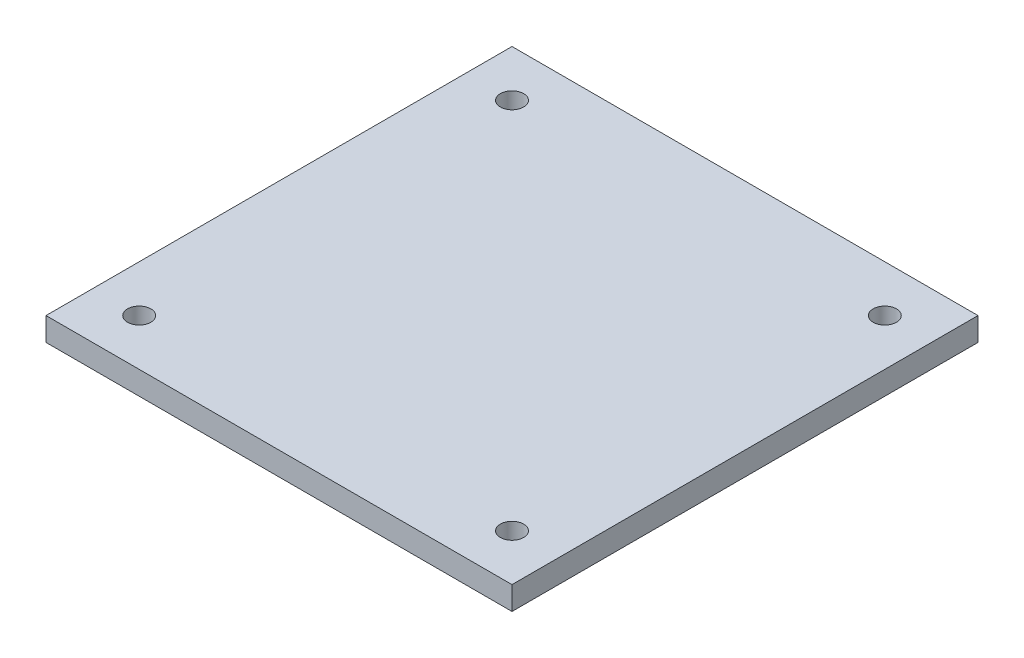
ISO-10303-21;
HEADER;
FILE_DESCRIPTION(('STEP AP214'),'2;1');
FILE_NAME('part.step','',(''),(''),'','','');
FILE_SCHEMA(('AUTOMOTIVE_DESIGN { 1 0 10303 214 1 1 1 1 }'));
ENDSEC;
DATA;
#1=APPLICATION_CONTEXT('core data for automotive mechanical design processes');
#2=APPLICATION_PROTOCOL_DEFINITION('international standard','automotive_design',2000,#1);
#3=PRODUCT_CONTEXT('',#1,'mechanical');
#4=PRODUCT('Part','Part','',(#3));
#5=PRODUCT_RELATED_PRODUCT_CATEGORY('part','',(#4));
#6=PRODUCT_DEFINITION_FORMATION('','',#4);
#7=PRODUCT_DEFINITION_CONTEXT('part definition',#1,'design');
#8=PRODUCT_DEFINITION('design','',#6,#7);
#9=PRODUCT_DEFINITION_SHAPE('','',#8);
#10=(LENGTH_UNIT() NAMED_UNIT(*) SI_UNIT(.MILLI.,.METRE.));
#11=(NAMED_UNIT(*) PLANE_ANGLE_UNIT() SI_UNIT($,.RADIAN.));
#12=(NAMED_UNIT(*) SI_UNIT($,.STERADIAN.) SOLID_ANGLE_UNIT());
#13=UNCERTAINTY_MEASURE_WITH_UNIT(LENGTH_MEASURE(1.E-05),#10,'distance_accuracy_value','');
#14=(GEOMETRIC_REPRESENTATION_CONTEXT(3) GLOBAL_UNCERTAINTY_ASSIGNED_CONTEXT((#13)) GLOBAL_UNIT_ASSIGNED_CONTEXT((#10,
#11,#12)) REPRESENTATION_CONTEXT('',''));
#15=CARTESIAN_POINT('',(0.,0.,0.));
#16=DIRECTION('',(0.,0.,1.));
#17=DIRECTION('',(1.,0.,0.));
#18=AXIS2_PLACEMENT_3D('',#15,#16,#17);
#19=CARTESIAN_POINT('',(100.,10.,100.));
#20=DIRECTION('',(-1.,0.,0.));
#21=DIRECTION('',(0.,0.,1.));
#22=AXIS2_PLACEMENT_3D('',#19,#20,#21);
#23=PLANE('',#22);
#24=DIRECTION('',(0.,0.,-1.));
#25=VECTOR('',#24,1.);
#26=CARTESIAN_POINT('',(100.,0.,100.));
#27=LINE('',#26,#25);
#28=CARTESIAN_POINT('',(100.,0.,100.));
#29=VERTEX_POINT('',#28);
#30=CARTESIAN_POINT('',(100.,0.,-100.));
#31=VERTEX_POINT('',#30);
#32=EDGE_CURVE('E214',#29,#31,#27,.T.);
#33=ORIENTED_EDGE('',*,*,#32,.T.);
#34=DIRECTION('',(0.,-1.,0.));
#35=VECTOR('',#34,1.);
#36=CARTESIAN_POINT('',(100.,10.,-100.));
#37=LINE('',#36,#35);
#38=CARTESIAN_POINT('',(100.,10.,-100.));
#39=VERTEX_POINT('',#38);
#40=EDGE_CURVE('E12',#39,#31,#37,.T.);
#41=ORIENTED_EDGE('',*,*,#40,.F.);
#42=DIRECTION('',(0.,0.,-1.));
#43=VECTOR('',#42,1.);
#44=CARTESIAN_POINT('',(100.,10.,100.));
#45=LINE('',#44,#43);
#46=CARTESIAN_POINT('',(100.,10.,100.));
#47=VERTEX_POINT('',#46);
#48=EDGE_CURVE('E98',#47,#39,#45,.T.);
#49=ORIENTED_EDGE('',*,*,#48,.F.);
#50=DIRECTION('',(0.,-1.,0.));
#51=VECTOR('',#50,1.);
#52=CARTESIAN_POINT('',(100.,10.,100.));
#53=LINE('',#52,#51);
#54=EDGE_CURVE('E110',#47,#29,#53,.T.);
#55=ORIENTED_EDGE('',*,*,#54,.T.);
#56=EDGE_LOOP('',(#33,#41,#49,#55));
#57=FACE_BOUND('',#56,.T.);
#58=ADVANCED_FACE('F45',(#57),#23,.F.);
#59=CARTESIAN_POINT('',(-100.,10.,-100.));
#60=DIRECTION('',(0.,0.,1.));
#61=DIRECTION('',(1.,0.,0.));
#62=AXIS2_PLACEMENT_3D('',#59,#60,#61);
#63=PLANE('',#62);
#64=DIRECTION('',(-1.,0.,0.));
#65=VECTOR('',#64,1.);
#66=CARTESIAN_POINT('',(-100.,0.,-100.));
#67=LINE('',#66,#65);
#68=CARTESIAN_POINT('',(-100.,0.,-100.));
#69=VERTEX_POINT('',#68);
#70=EDGE_CURVE('E103',#31,#69,#67,.T.);
#71=ORIENTED_EDGE('',*,*,#70,.T.);
#72=DIRECTION('',(0.,-1.,0.));
#73=VECTOR('',#72,1.);
#74=CARTESIAN_POINT('',(-100.,10.,-100.));
#75=LINE('',#74,#73);
#76=CARTESIAN_POINT('',(-100.,10.,-100.));
#77=VERTEX_POINT('',#76);
#78=EDGE_CURVE('E55',#77,#69,#75,.T.);
#79=ORIENTED_EDGE('',*,*,#78,.F.);
#80=DIRECTION('',(-1.,0.,0.));
#81=VECTOR('',#80,1.);
#82=CARTESIAN_POINT('',(-100.,10.,-100.));
#83=LINE('',#82,#81);
#84=EDGE_CURVE('E93',#39,#77,#83,.T.);
#85=ORIENTED_EDGE('',*,*,#84,.F.);
#86=ORIENTED_EDGE('',*,*,#40,.T.);
#87=EDGE_LOOP('',(#71,#79,#85,#86));
#88=FACE_BOUND('',#87,.T.);
#89=ADVANCED_FACE('F102',(#88),#63,.F.);
#90=CARTESIAN_POINT('',(-100.,10.,100.));
#91=DIRECTION('',(1.,0.,0.));
#92=DIRECTION('',(0.,0.,-1.));
#93=AXIS2_PLACEMENT_3D('',#90,#91,#92);
#94=PLANE('',#93);
#95=DIRECTION('',(0.,0.,1.));
#96=VECTOR('',#95,1.);
#97=CARTESIAN_POINT('',(-100.,0.,100.));
#98=LINE('',#97,#96);
#99=CARTESIAN_POINT('',(-100.,0.,100.));
#100=VERTEX_POINT('',#99);
#101=EDGE_CURVE('E80',#69,#100,#98,.T.);
#102=ORIENTED_EDGE('',*,*,#101,.T.);
#103=DIRECTION('',(0.,-1.,0.));
#104=VECTOR('',#103,1.);
#105=CARTESIAN_POINT('',(-100.,10.,100.));
#106=LINE('',#105,#104);
#107=CARTESIAN_POINT('',(-100.,10.,100.));
#108=VERTEX_POINT('',#107);
#109=EDGE_CURVE('E105',#108,#100,#106,.T.);
#110=ORIENTED_EDGE('',*,*,#109,.F.);
#111=DIRECTION('',(0.,0.,1.));
#112=VECTOR('',#111,1.);
#113=CARTESIAN_POINT('',(-100.,10.,100.));
#114=LINE('',#113,#112);
#115=EDGE_CURVE('E96',#77,#108,#114,.T.);
#116=ORIENTED_EDGE('',*,*,#115,.F.);
#117=ORIENTED_EDGE('',*,*,#78,.T.);
#118=EDGE_LOOP('',(#102,#110,#116,#117));
#119=FACE_BOUND('',#118,.T.);
#120=ADVANCED_FACE('F106',(#119),#94,.F.);
#121=CARTESIAN_POINT('',(-100.,10.,100.));
#122=DIRECTION('',(0.,0.,-1.));
#123=DIRECTION('',(-1.,0.,0.));
#124=AXIS2_PLACEMENT_3D('',#121,#122,#123);
#125=PLANE('',#124);
#126=DIRECTION('',(1.,0.,0.));
#127=VECTOR('',#126,1.);
#128=CARTESIAN_POINT('',(-100.,0.,100.));
#129=LINE('',#128,#127);
#130=EDGE_CURVE('E86',#100,#29,#129,.T.);
#131=ORIENTED_EDGE('',*,*,#130,.T.);
#132=ORIENTED_EDGE('',*,*,#54,.F.);
#133=DIRECTION('',(1.,0.,0.));
#134=VECTOR('',#133,1.);
#135=CARTESIAN_POINT('',(-100.,10.,100.));
#136=LINE('',#135,#134);
#137=EDGE_CURVE('E63',#108,#47,#136,.T.);
#138=ORIENTED_EDGE('',*,*,#137,.F.);
#139=ORIENTED_EDGE('',*,*,#109,.T.);
#140=EDGE_LOOP('',(#131,#132,#138,#139));
#141=FACE_BOUND('',#140,.T.);
#142=ADVANCED_FACE('F439',(#141),#125,.F.);
#143=CARTESIAN_POINT('',(0.,10.,0.));
#144=DIRECTION('',(0.,-1.,0.));
#145=DIRECTION('',(0.,0.,-1.));
#146=AXIS2_PLACEMENT_3D('',#143,#144,#145);
#147=PLANE('',#146);
#148=CARTESIAN_POINT('',(80.,10.,-80.));
#149=DIRECTION('',(0.,1.,0.));
#150=DIRECTION('',(0.,0.,-1.));
#151=AXIS2_PLACEMENT_3D('',#148,#149,#150);
#152=CIRCLE('',#151,5.00000000000001);
#153=CARTESIAN_POINT('',(80.,10.,-85.));
#154=VERTEX_POINT('',#153);
#155=EDGE_CURVE('E245',#154,#154,#152,.T.);
#156=ORIENTED_EDGE('',*,*,#155,.F.);
#157=EDGE_LOOP('',(#156));
#158=FACE_BOUND('',#157,.T.);
#159=CARTESIAN_POINT('',(-80.,10.,-80.));
#160=DIRECTION('',(0.,1.,0.));
#161=DIRECTION('',(0.,0.,1.));
#162=AXIS2_PLACEMENT_3D('',#159,#160,#161);
#163=CIRCLE('',#162,5.00000000000001);
#164=CARTESIAN_POINT('',(-80.,10.,-75.));
#165=VERTEX_POINT('',#164);
#166=EDGE_CURVE('E312',#165,#165,#163,.T.);
#167=ORIENTED_EDGE('',*,*,#166,.F.);
#168=EDGE_LOOP('',(#167));
#169=FACE_BOUND('',#168,.T.);
#170=CARTESIAN_POINT('',(-80.,10.,80.));
#171=DIRECTION('',(0.,1.,0.));
#172=DIRECTION('',(0.,0.,-1.));
#173=AXIS2_PLACEMENT_3D('',#170,#171,#172);
#174=CIRCLE('',#173,5.00000000000001);
#175=CARTESIAN_POINT('',(-80.,10.,75.));
#176=VERTEX_POINT('',#175);
#177=EDGE_CURVE('E279',#176,#176,#174,.T.);
#178=ORIENTED_EDGE('',*,*,#177,.F.);
#179=EDGE_LOOP('',(#178));
#180=FACE_BOUND('',#179,.T.);
#181=CARTESIAN_POINT('',(80.,10.,80.));
#182=DIRECTION('',(0.,1.,0.));
#183=DIRECTION('',(0.,0.,1.));
#184=AXIS2_PLACEMENT_3D('',#181,#182,#183);
#185=CIRCLE('',#184,5.00000000000001);
#186=CARTESIAN_POINT('',(80.,10.,85.));
#187=VERTEX_POINT('',#186);
#188=EDGE_CURVE('E158',#187,#187,#185,.T.);
#189=ORIENTED_EDGE('',*,*,#188,.F.);
#190=EDGE_LOOP('',(#189));
#191=FACE_BOUND('',#190,.T.);
#192=ORIENTED_EDGE('',*,*,#48,.T.);
#193=ORIENTED_EDGE('',*,*,#84,.T.);
#194=ORIENTED_EDGE('',*,*,#115,.T.);
#195=ORIENTED_EDGE('',*,*,#137,.T.);
#196=EDGE_LOOP('',(#192,#193,#194,#195));
#197=FACE_BOUND('',#196,.T.);
#198=ADVANCED_FACE('F94',(#158,#169,#180,#191,#197),#147,.F.);
#199=CARTESIAN_POINT('',(0.,0.,0.));
#200=DIRECTION('',(0.,-1.,0.));
#201=DIRECTION('',(0.,0.,-1.));
#202=AXIS2_PLACEMENT_3D('',#199,#200,#201);
#203=PLANE('',#202);
#204=CARTESIAN_POINT('',(80.,0.,-80.));
#205=DIRECTION('',(0.,1.,0.));
#206=DIRECTION('',(0.,0.,-1.));
#207=AXIS2_PLACEMENT_3D('',#204,#205,#206);
#208=CIRCLE('',#207,5.00000000000001);
#209=CARTESIAN_POINT('',(80.,0.,-85.));
#210=VERTEX_POINT('',#209);
#211=EDGE_CURVE('E339',#210,#210,#208,.T.);
#212=ORIENTED_EDGE('',*,*,#211,.T.);
#213=EDGE_LOOP('',(#212));
#214=FACE_BOUND('',#213,.T.);
#215=CARTESIAN_POINT('',(-80.,0.,-80.));
#216=DIRECTION('',(0.,1.,0.));
#217=DIRECTION('',(0.,0.,1.));
#218=AXIS2_PLACEMENT_3D('',#215,#216,#217);
#219=CIRCLE('',#218,5.00000000000001);
#220=CARTESIAN_POINT('',(-80.,0.,-75.));
#221=VERTEX_POINT('',#220);
#222=EDGE_CURVE('E308',#221,#221,#219,.T.);
#223=ORIENTED_EDGE('',*,*,#222,.T.);
#224=EDGE_LOOP('',(#223));
#225=FACE_BOUND('',#224,.T.);
#226=CARTESIAN_POINT('',(-80.,0.,80.));
#227=DIRECTION('',(0.,1.,0.));
#228=DIRECTION('',(0.,0.,-1.));
#229=AXIS2_PLACEMENT_3D('',#226,#227,#228);
#230=CIRCLE('',#229,5.00000000000001);
#231=CARTESIAN_POINT('',(-80.,0.,75.));
#232=VERTEX_POINT('',#231);
#233=EDGE_CURVE('E275',#232,#232,#230,.T.);
#234=ORIENTED_EDGE('',*,*,#233,.T.);
#235=EDGE_LOOP('',(#234));
#236=FACE_BOUND('',#235,.T.);
#237=CARTESIAN_POINT('',(80.,0.,80.));
#238=DIRECTION('',(0.,1.,0.));
#239=DIRECTION('',(0.,0.,1.));
#240=AXIS2_PLACEMENT_3D('',#237,#238,#239);
#241=CIRCLE('',#240,5.00000000000001);
#242=CARTESIAN_POINT('',(80.,0.,85.));
#243=VERTEX_POINT('',#242);
#244=EDGE_CURVE('E241',#243,#243,#241,.T.);
#245=ORIENTED_EDGE('',*,*,#244,.T.);
#246=EDGE_LOOP('',(#245));
#247=FACE_BOUND('',#246,.T.);
#248=ORIENTED_EDGE('',*,*,#32,.F.);
#249=ORIENTED_EDGE('',*,*,#130,.F.);
#250=ORIENTED_EDGE('',*,*,#101,.F.);
#251=ORIENTED_EDGE('',*,*,#70,.F.);
#252=EDGE_LOOP('',(#248,#249,#250,#251));
#253=FACE_BOUND('',#252,.T.);
#254=ADVANCED_FACE('F422',(#214,#225,#236,#247,#253),#203,.T.);
#255=CARTESIAN_POINT('',(80.,0.,80.));
#256=DIRECTION('',(0.,1.,0.));
#257=DIRECTION('',(0.,0.,1.));
#258=AXIS2_PLACEMENT_3D('',#255,#256,#257);
#259=CYLINDRICAL_SURFACE('',#258,5.00000000000001);
#260=ORIENTED_EDGE('',*,*,#244,.F.);
#261=EDGE_LOOP('',(#260));
#262=FACE_BOUND('',#261,.T.);
#263=ORIENTED_EDGE('',*,*,#188,.T.);
#264=EDGE_LOOP('',(#263));
#265=FACE_BOUND('',#264,.T.);
#266=ADVANCED_FACE('F447',(#262,#265),#259,.F.);
#267=CARTESIAN_POINT('',(-80.,0.,80.));
#268=DIRECTION('',(0.,1.,0.));
#269=DIRECTION('',(0.,0.,1.));
#270=AXIS2_PLACEMENT_3D('',#267,#268,#269);
#271=CYLINDRICAL_SURFACE('',#270,5.00000000000001);
#272=ORIENTED_EDGE('',*,*,#233,.F.);
#273=EDGE_LOOP('',(#272));
#274=FACE_BOUND('',#273,.T.);
#275=ORIENTED_EDGE('',*,*,#177,.T.);
#276=EDGE_LOOP('',(#275));
#277=FACE_BOUND('',#276,.T.);
#278=ADVANCED_FACE('F449',(#274,#277),#271,.F.);
#279=CARTESIAN_POINT('',(-80.,0.,-80.));
#280=DIRECTION('',(0.,1.,0.));
#281=DIRECTION('',(0.,0.,1.));
#282=AXIS2_PLACEMENT_3D('',#279,#280,#281);
#283=CYLINDRICAL_SURFACE('',#282,5.00000000000001);
#284=ORIENTED_EDGE('',*,*,#222,.F.);
#285=EDGE_LOOP('',(#284));
#286=FACE_BOUND('',#285,.T.);
#287=ORIENTED_EDGE('',*,*,#166,.T.);
#288=EDGE_LOOP('',(#287));
#289=FACE_BOUND('',#288,.T.);
#290=ADVANCED_FACE('F456',(#286,#289),#283,.F.);
#291=CARTESIAN_POINT('',(80.,0.,-80.));
#292=DIRECTION('',(0.,1.,0.));
#293=DIRECTION('',(0.,0.,1.));
#294=AXIS2_PLACEMENT_3D('',#291,#292,#293);
#295=CYLINDRICAL_SURFACE('',#294,5.00000000000001);
#296=ORIENTED_EDGE('',*,*,#211,.F.);
#297=EDGE_LOOP('',(#296));
#298=FACE_BOUND('',#297,.T.);
#299=ORIENTED_EDGE('',*,*,#155,.T.);
#300=EDGE_LOOP('',(#299));
#301=FACE_BOUND('',#300,.T.);
#302=ADVANCED_FACE('F435',(#298,#301),#295,.F.);
#303=CLOSED_SHELL('',(#58,#89,#120,#142,#198,#254,#266,#278,#290,#302));
#304=MANIFOLD_SOLID_BREP('B2',#303);
#305=ADVANCED_BREP_SHAPE_REPRESENTATION('',(#18,#304),#14);
#306=SHAPE_DEFINITION_REPRESENTATION(#9,#305);
ENDSEC;
END-ISO-10303-21;
